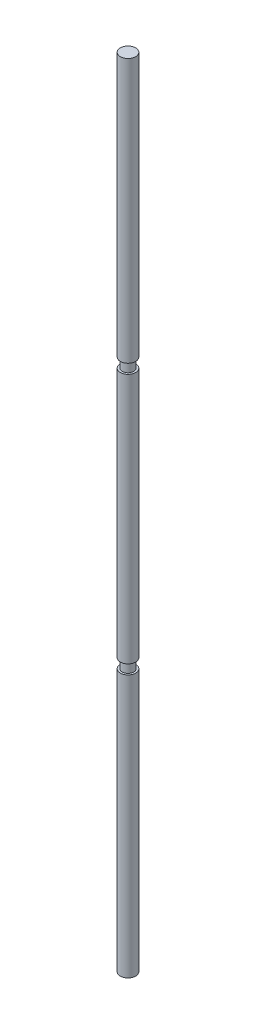
ISO-10303-21;
HEADER;
FILE_DESCRIPTION(('STEP AP214'),'2;1');
FILE_NAME('part.step','',(''),(''),'','','');
FILE_SCHEMA(('AUTOMOTIVE_DESIGN { 1 0 10303 214 1 1 1 1 }'));
ENDSEC;
DATA;
#1=APPLICATION_CONTEXT('core data for automotive mechanical design processes');
#2=APPLICATION_PROTOCOL_DEFINITION('international standard','automotive_design',2000,#1);
#3=PRODUCT_CONTEXT('',#1,'mechanical');
#4=PRODUCT('Part','Part','',(#3));
#5=PRODUCT_RELATED_PRODUCT_CATEGORY('part','',(#4));
#6=PRODUCT_DEFINITION_FORMATION('','',#4);
#7=PRODUCT_DEFINITION_CONTEXT('part definition',#1,'design');
#8=PRODUCT_DEFINITION('design','',#6,#7);
#9=PRODUCT_DEFINITION_SHAPE('','',#8);
#10=(LENGTH_UNIT() NAMED_UNIT(*) SI_UNIT(.MILLI.,.METRE.));
#11=(NAMED_UNIT(*) PLANE_ANGLE_UNIT() SI_UNIT($,.RADIAN.));
#12=(NAMED_UNIT(*) SI_UNIT($,.STERADIAN.) SOLID_ANGLE_UNIT());
#13=UNCERTAINTY_MEASURE_WITH_UNIT(LENGTH_MEASURE(1.E-05),#10,'distance_accuracy_value','');
#14=(GEOMETRIC_REPRESENTATION_CONTEXT(3) GLOBAL_UNCERTAINTY_ASSIGNED_CONTEXT((#13)) GLOBAL_UNIT_ASSIGNED_CONTEXT((#10,
#11,#12)) REPRESENTATION_CONTEXT('',''));
#15=CARTESIAN_POINT('',(0.,0.,0.));
#16=DIRECTION('',(0.,0.,1.));
#17=DIRECTION('',(1.,0.,0.));
#18=AXIS2_PLACEMENT_3D('',#15,#16,#17);
#19=CARTESIAN_POINT('',(0.,330.2,0.));
#20=DIRECTION('',(0.,-1.,0.));
#21=DIRECTION('',(0.,0.,-1.));
#22=AXIS2_PLACEMENT_3D('',#19,#20,#21);
#23=CYLINDRICAL_SURFACE('',#22,3.175);
#24=CARTESIAN_POINT('',(0.,112.79886,0.));
#25=DIRECTION('',(0.,1.,0.));
#26=DIRECTION('',(0.,0.,1.));
#27=AXIS2_PLACEMENT_3D('',#24,#25,#26);
#28=CIRCLE('',#27,3.175);
#29=CARTESIAN_POINT('',(0.,112.79886,3.175));
#30=VERTEX_POINT('',#29);
#31=EDGE_CURVE('E43',#30,#30,#28,.T.);
#32=ORIENTED_EDGE('',*,*,#31,.T.);
#33=EDGE_LOOP('',(#32));
#34=FACE_BOUND('',#33,.T.);
#35=CARTESIAN_POINT('',(0.,216.78011,0.));
#36=DIRECTION('',(0.,1.,0.));
#37=DIRECTION('',(0.,0.,1.));
#38=AXIS2_PLACEMENT_3D('',#35,#36,#37);
#39=CIRCLE('',#38,3.175);
#40=CARTESIAN_POINT('',(0.,216.78011,3.175));
#41=VERTEX_POINT('',#40);
#42=EDGE_CURVE('E54',#41,#41,#39,.T.);
#43=ORIENTED_EDGE('',*,*,#42,.F.);
#44=EDGE_LOOP('',(#43));
#45=FACE_BOUND('',#44,.T.);
#46=ADVANCED_FACE('F30',(#34,#45),#23,.T.);
#47=CARTESIAN_POINT('',(0.,112.79886,0.));
#48=DIRECTION('',(0.,1.,0.));
#49=DIRECTION('',(0.,0.,1.));
#50=AXIS2_PLACEMENT_3D('',#47,#48,#49);
#51=PLANE('',#50);
#52=CARTESIAN_POINT('',(0.,112.79886,0.));
#53=DIRECTION('',(0.,1.,0.));
#54=DIRECTION('',(0.,0.,1.));
#55=AXIS2_PLACEMENT_3D('',#52,#53,#54);
#56=CIRCLE('',#55,2.38125);
#57=CARTESIAN_POINT('',(0.,112.79886,2.38125));
#58=VERTEX_POINT('',#57);
#59=EDGE_CURVE('E52',#58,#58,#56,.T.);
#60=ORIENTED_EDGE('',*,*,#59,.T.);
#61=EDGE_LOOP('',(#60));
#62=FACE_BOUND('',#61,.T.);
#63=ORIENTED_EDGE('',*,*,#31,.F.);
#64=EDGE_LOOP('',(#63));
#65=FACE_BOUND('',#64,.T.);
#66=ADVANCED_FACE('F78',(#62,#65),#51,.F.);
#67=CARTESIAN_POINT('',(0.,108.83011,0.));
#68=DIRECTION('',(0.,1.,0.));
#69=DIRECTION('',(0.,0.,1.));
#70=AXIS2_PLACEMENT_3D('',#67,#68,#69);
#71=PLANE('',#70);
#72=CARTESIAN_POINT('',(0.,108.83011,0.));
#73=DIRECTION('',(0.,1.,0.));
#74=DIRECTION('',(0.,0.,1.));
#75=AXIS2_PLACEMENT_3D('',#72,#73,#74);
#76=CIRCLE('',#75,2.38125);
#77=CARTESIAN_POINT('',(0.,108.83011,2.38125));
#78=VERTEX_POINT('',#77);
#79=EDGE_CURVE('E46',#78,#78,#76,.T.);
#80=ORIENTED_EDGE('',*,*,#79,.F.);
#81=EDGE_LOOP('',(#80));
#82=FACE_BOUND('',#81,.T.);
#83=CARTESIAN_POINT('',(0.,108.83011,0.));
#84=DIRECTION('',(0.,1.,0.));
#85=DIRECTION('',(0.,0.,1.));
#86=AXIS2_PLACEMENT_3D('',#83,#84,#85);
#87=CIRCLE('',#86,3.175);
#88=CARTESIAN_POINT('',(0.,108.83011,3.175));
#89=VERTEX_POINT('',#88);
#90=EDGE_CURVE('E49',#89,#89,#87,.T.);
#91=ORIENTED_EDGE('',*,*,#90,.T.);
#92=EDGE_LOOP('',(#91));
#93=FACE_BOUND('',#92,.T.);
#94=ADVANCED_FACE('F75',(#82,#93),#71,.T.);
#95=CARTESIAN_POINT('',(0.,112.79886,0.));
#96=DIRECTION('',(0.,-1.,0.));
#97=DIRECTION('',(0.,0.,-1.));
#98=AXIS2_PLACEMENT_3D('',#95,#96,#97);
#99=CYLINDRICAL_SURFACE('',#98,2.38125);
#100=ORIENTED_EDGE('',*,*,#59,.F.);
#101=EDGE_LOOP('',(#100));
#102=FACE_BOUND('',#101,.T.);
#103=ORIENTED_EDGE('',*,*,#79,.T.);
#104=EDGE_LOOP('',(#103));
#105=FACE_BOUND('',#104,.T.);
#106=ADVANCED_FACE('F73',(#102,#105),#99,.T.);
#107=CARTESIAN_POINT('',(0.,0.,0.));
#108=DIRECTION('',(0.,1.,0.));
#109=DIRECTION('',(0.,0.,1.));
#110=AXIS2_PLACEMENT_3D('',#107,#108,#109);
#111=PLANE('',#110);
#112=CARTESIAN_POINT('',(0.,0.,0.));
#113=DIRECTION('',(0.,1.,0.));
#114=DIRECTION('',(0.,0.,1.));
#115=AXIS2_PLACEMENT_3D('',#112,#113,#114);
#116=CIRCLE('',#115,3.175);
#117=CARTESIAN_POINT('',(0.,0.,3.175));
#118=VERTEX_POINT('',#117);
#119=EDGE_CURVE('E38',#118,#118,#116,.T.);
#120=ORIENTED_EDGE('',*,*,#119,.F.);
#121=EDGE_LOOP('',(#120));
#122=FACE_BOUND('',#121,.T.);
#123=ADVANCED_FACE('F85',(#122),#111,.F.);
#124=ORIENTED_EDGE('',*,*,#119,.T.);
#125=EDGE_LOOP('',(#124));
#126=FACE_BOUND('',#125,.T.);
#127=ORIENTED_EDGE('',*,*,#90,.F.);
#128=EDGE_LOOP('',(#127));
#129=FACE_BOUND('',#128,.T.);
#130=ADVANCED_FACE('F82',(#126,#129),#23,.T.);
#131=CARTESIAN_POINT('',(0.,220.74886,0.));
#132=DIRECTION('',(0.,1.,0.));
#133=DIRECTION('',(0.,0.,1.));
#134=AXIS2_PLACEMENT_3D('',#131,#132,#133);
#135=PLANE('',#134);
#136=CARTESIAN_POINT('',(0.,220.74886,0.));
#137=DIRECTION('',(0.,1.,0.));
#138=DIRECTION('',(0.,0.,1.));
#139=AXIS2_PLACEMENT_3D('',#136,#137,#138);
#140=CIRCLE('',#139,2.38125);
#141=CARTESIAN_POINT('',(0.,220.74886,2.38125));
#142=VERTEX_POINT('',#141);
#143=EDGE_CURVE('E56',#142,#142,#140,.T.);
#144=ORIENTED_EDGE('',*,*,#143,.T.);
#145=EDGE_LOOP('',(#144));
#146=FACE_BOUND('',#145,.T.);
#147=CARTESIAN_POINT('',(0.,220.74886,0.));
#148=DIRECTION('',(0.,1.,0.));
#149=DIRECTION('',(0.,0.,1.));
#150=AXIS2_PLACEMENT_3D('',#147,#148,#149);
#151=CIRCLE('',#150,3.175);
#152=CARTESIAN_POINT('',(0.,220.74886,3.175));
#153=VERTEX_POINT('',#152);
#154=EDGE_CURVE('E34',#153,#153,#151,.T.);
#155=ORIENTED_EDGE('',*,*,#154,.F.);
#156=EDGE_LOOP('',(#155));
#157=FACE_BOUND('',#156,.T.);
#158=ADVANCED_FACE('F84',(#146,#157),#135,.F.);
#159=CARTESIAN_POINT('',(0.,216.78011,0.));
#160=DIRECTION('',(0.,1.,0.));
#161=DIRECTION('',(0.,0.,1.));
#162=AXIS2_PLACEMENT_3D('',#159,#160,#161);
#163=PLANE('',#162);
#164=CARTESIAN_POINT('',(0.,216.78011,0.));
#165=DIRECTION('',(0.,1.,0.));
#166=DIRECTION('',(0.,0.,1.));
#167=AXIS2_PLACEMENT_3D('',#164,#165,#166);
#168=CIRCLE('',#167,2.38125);
#169=CARTESIAN_POINT('',(0.,216.78011,2.38125));
#170=VERTEX_POINT('',#169);
#171=EDGE_CURVE('E61',#170,#170,#168,.T.);
#172=ORIENTED_EDGE('',*,*,#171,.F.);
#173=EDGE_LOOP('',(#172));
#174=FACE_BOUND('',#173,.T.);
#175=ORIENTED_EDGE('',*,*,#42,.T.);
#176=EDGE_LOOP('',(#175));
#177=FACE_BOUND('',#176,.T.);
#178=ADVANCED_FACE('F91',(#174,#177),#163,.T.);
#179=CARTESIAN_POINT('',(0.,220.74886,0.));
#180=DIRECTION('',(0.,-1.,0.));
#181=DIRECTION('',(0.,0.,-1.));
#182=AXIS2_PLACEMENT_3D('',#179,#180,#181);
#183=CYLINDRICAL_SURFACE('',#182,2.38125);
#184=ORIENTED_EDGE('',*,*,#143,.F.);
#185=EDGE_LOOP('',(#184));
#186=FACE_BOUND('',#185,.T.);
#187=ORIENTED_EDGE('',*,*,#171,.T.);
#188=EDGE_LOOP('',(#187));
#189=FACE_BOUND('',#188,.T.);
#190=ADVANCED_FACE('F112',(#186,#189),#183,.T.);
#191=CARTESIAN_POINT('',(0.,330.2,0.));
#192=DIRECTION('',(0.,1.,0.));
#193=DIRECTION('',(0.,0.,1.));
#194=AXIS2_PLACEMENT_3D('',#191,#192,#193);
#195=PLANE('',#194);
#196=CARTESIAN_POINT('',(0.,330.2,0.));
#197=DIRECTION('',(0.,1.,0.));
#198=DIRECTION('',(0.,0.,1.));
#199=AXIS2_PLACEMENT_3D('',#196,#197,#198);
#200=CIRCLE('',#199,3.175);
#201=CARTESIAN_POINT('',(0.,330.2,3.175));
#202=VERTEX_POINT('',#201);
#203=EDGE_CURVE('E10',#202,#202,#200,.T.);
#204=ORIENTED_EDGE('',*,*,#203,.T.);
#205=EDGE_LOOP('',(#204));
#206=FACE_BOUND('',#205,.T.);
#207=ADVANCED_FACE('F95',(#206),#195,.T.);
#208=ORIENTED_EDGE('',*,*,#154,.T.);
#209=EDGE_LOOP('',(#208));
#210=FACE_BOUND('',#209,.T.);
#211=ORIENTED_EDGE('',*,*,#203,.F.);
#212=EDGE_LOOP('',(#211));
#213=FACE_BOUND('',#212,.T.);
#214=ADVANCED_FACE('F32',(#210,#213),#23,.T.);
#215=CLOSED_SHELL('',(#46,#66,#94,#106,#123,#130,#158,#178,#190,#207,#214));
#216=MANIFOLD_SOLID_BREP('B2',#215);
#217=ADVANCED_BREP_SHAPE_REPRESENTATION('',(#18,#216),#14);
#218=SHAPE_DEFINITION_REPRESENTATION(#9,#217);
ENDSEC;
END-ISO-10303-21;
